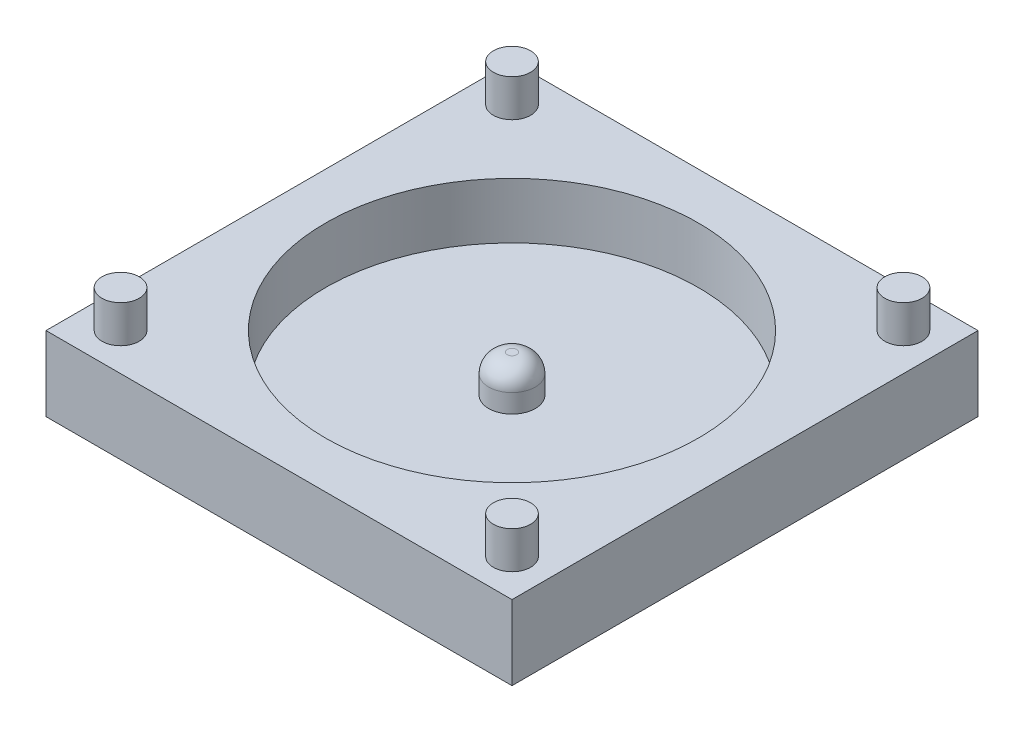
ISO-10303-21;
HEADER;
FILE_DESCRIPTION(('STEP AP214'),'2;1');
FILE_NAME('part.step','',(''),(''),'','','');
FILE_SCHEMA(('AUTOMOTIVE_DESIGN { 1 0 10303 214 1 1 1 1 }'));
ENDSEC;
DATA;
#1=APPLICATION_CONTEXT('core data for automotive mechanical design processes');
#2=APPLICATION_PROTOCOL_DEFINITION('international standard','automotive_design',2000,#1);
#3=PRODUCT_CONTEXT('',#1,'mechanical');
#4=PRODUCT('Part','Part','',(#3));
#5=PRODUCT_RELATED_PRODUCT_CATEGORY('part','',(#4));
#6=PRODUCT_DEFINITION_FORMATION('','',#4);
#7=PRODUCT_DEFINITION_CONTEXT('part definition',#1,'design');
#8=PRODUCT_DEFINITION('design','',#6,#7);
#9=PRODUCT_DEFINITION_SHAPE('','',#8);
#10=(LENGTH_UNIT() NAMED_UNIT(*) SI_UNIT(.MILLI.,.METRE.));
#11=(NAMED_UNIT(*) PLANE_ANGLE_UNIT() SI_UNIT($,.RADIAN.));
#12=(NAMED_UNIT(*) SI_UNIT($,.STERADIAN.) SOLID_ANGLE_UNIT());
#13=UNCERTAINTY_MEASURE_WITH_UNIT(LENGTH_MEASURE(1.E-05),#10,'distance_accuracy_value','');
#14=(GEOMETRIC_REPRESENTATION_CONTEXT(3) GLOBAL_UNCERTAINTY_ASSIGNED_CONTEXT((#13)) GLOBAL_UNIT_ASSIGNED_CONTEXT((#10,
#11,#12)) REPRESENTATION_CONTEXT('',''));
#15=CARTESIAN_POINT('',(0.,0.,0.));
#16=DIRECTION('',(0.,0.,1.));
#17=DIRECTION('',(1.,0.,0.));
#18=AXIS2_PLACEMENT_3D('',#15,#16,#17);
#19=CARTESIAN_POINT('',(12.5,4.,12.5));
#20=DIRECTION('',(-1.,0.,0.));
#21=DIRECTION('',(0.,0.,1.));
#22=AXIS2_PLACEMENT_3D('',#19,#20,#21);
#23=PLANE('',#22);
#24=DIRECTION('',(0.,0.,-1.));
#25=VECTOR('',#24,1.);
#26=CARTESIAN_POINT('',(12.5,0.,12.5));
#27=LINE('',#26,#25);
#28=CARTESIAN_POINT('',(12.5,0.,12.5));
#29=VERTEX_POINT('',#28);
#30=CARTESIAN_POINT('',(12.5,0.,-12.5));
#31=VERTEX_POINT('',#30);
#32=EDGE_CURVE('E101',#29,#31,#27,.T.);
#33=ORIENTED_EDGE('',*,*,#32,.T.);
#34=DIRECTION('',(0.,-1.,0.));
#35=VECTOR('',#34,1.);
#36=CARTESIAN_POINT('',(12.5,4.,-12.5));
#37=LINE('',#36,#35);
#38=CARTESIAN_POINT('',(12.5,4.,-12.5));
#39=VERTEX_POINT('',#38);
#40=EDGE_CURVE('E92',#39,#31,#37,.T.);
#41=ORIENTED_EDGE('',*,*,#40,.F.);
#42=DIRECTION('',(0.,0.,-1.));
#43=VECTOR('',#42,1.);
#44=CARTESIAN_POINT('',(12.5,4.,12.5));
#45=LINE('',#44,#43);
#46=CARTESIAN_POINT('',(12.5,4.,12.5));
#47=VERTEX_POINT('',#46);
#48=EDGE_CURVE('E86',#47,#39,#45,.T.);
#49=ORIENTED_EDGE('',*,*,#48,.F.);
#50=DIRECTION('',(0.,-1.,0.));
#51=VECTOR('',#50,1.);
#52=CARTESIAN_POINT('',(12.5,4.,12.5));
#53=LINE('',#52,#51);
#54=EDGE_CURVE('E97',#47,#29,#53,.T.);
#55=ORIENTED_EDGE('',*,*,#54,.T.);
#56=EDGE_LOOP('',(#33,#41,#49,#55));
#57=FACE_BOUND('',#56,.T.);
#58=ADVANCED_FACE('F33',(#57),#23,.F.);
#59=CARTESIAN_POINT('',(-12.5,4.,-12.5));
#60=DIRECTION('',(0.,0.,1.));
#61=DIRECTION('',(1.,0.,0.));
#62=AXIS2_PLACEMENT_3D('',#59,#60,#61);
#63=PLANE('',#62);
#64=DIRECTION('',(-1.,0.,0.));
#65=VECTOR('',#64,1.);
#66=CARTESIAN_POINT('',(-12.5,0.,-12.5));
#67=LINE('',#66,#65);
#68=CARTESIAN_POINT('',(-12.5,0.,-12.5));
#69=VERTEX_POINT('',#68);
#70=EDGE_CURVE('E91',#31,#69,#67,.T.);
#71=ORIENTED_EDGE('',*,*,#70,.T.);
#72=DIRECTION('',(0.,-1.,0.));
#73=VECTOR('',#72,1.);
#74=CARTESIAN_POINT('',(-12.5,4.,-12.5));
#75=LINE('',#74,#73);
#76=CARTESIAN_POINT('',(-12.5,4.,-12.5));
#77=VERTEX_POINT('',#76);
#78=EDGE_CURVE('E89',#77,#69,#75,.T.);
#79=ORIENTED_EDGE('',*,*,#78,.F.);
#80=DIRECTION('',(-1.,0.,0.));
#81=VECTOR('',#80,1.);
#82=CARTESIAN_POINT('',(-12.5,4.,-12.5));
#83=LINE('',#82,#81);
#84=EDGE_CURVE('E81',#39,#77,#83,.T.);
#85=ORIENTED_EDGE('',*,*,#84,.F.);
#86=ORIENTED_EDGE('',*,*,#40,.T.);
#87=EDGE_LOOP('',(#71,#79,#85,#86));
#88=FACE_BOUND('',#87,.T.);
#89=ADVANCED_FACE('F90',(#88),#63,.F.);
#90=CARTESIAN_POINT('',(-12.5,4.,12.5));
#91=DIRECTION('',(1.,0.,0.));
#92=DIRECTION('',(0.,0.,-1.));
#93=AXIS2_PLACEMENT_3D('',#90,#91,#92);
#94=PLANE('',#93);
#95=DIRECTION('',(0.,0.,1.));
#96=VECTOR('',#95,1.);
#97=CARTESIAN_POINT('',(-12.5,0.,12.5));
#98=LINE('',#97,#96);
#99=CARTESIAN_POINT('',(-12.5,0.,12.5));
#100=VERTEX_POINT('',#99);
#101=EDGE_CURVE('E67',#69,#100,#98,.T.);
#102=ORIENTED_EDGE('',*,*,#101,.T.);
#103=DIRECTION('',(0.,-1.,0.));
#104=VECTOR('',#103,1.);
#105=CARTESIAN_POINT('',(-12.5,4.,12.5));
#106=LINE('',#105,#104);
#107=CARTESIAN_POINT('',(-12.5,4.,12.5));
#108=VERTEX_POINT('',#107);
#109=EDGE_CURVE('E93',#108,#100,#106,.T.);
#110=ORIENTED_EDGE('',*,*,#109,.F.);
#111=DIRECTION('',(0.,0.,1.));
#112=VECTOR('',#111,1.);
#113=CARTESIAN_POINT('',(-12.5,4.,12.5));
#114=LINE('',#113,#112);
#115=EDGE_CURVE('E84',#77,#108,#114,.T.);
#116=ORIENTED_EDGE('',*,*,#115,.F.);
#117=ORIENTED_EDGE('',*,*,#78,.T.);
#118=EDGE_LOOP('',(#102,#110,#116,#117));
#119=FACE_BOUND('',#118,.T.);
#120=ADVANCED_FACE('F95',(#119),#94,.F.);
#121=CARTESIAN_POINT('',(-12.5,4.,12.5));
#122=DIRECTION('',(0.,0.,-1.));
#123=DIRECTION('',(-1.,0.,0.));
#124=AXIS2_PLACEMENT_3D('',#121,#122,#123);
#125=PLANE('',#124);
#126=DIRECTION('',(1.,0.,0.));
#127=VECTOR('',#126,1.);
#128=CARTESIAN_POINT('',(-12.5,0.,12.5));
#129=LINE('',#128,#127);
#130=EDGE_CURVE('E73',#100,#29,#129,.T.);
#131=ORIENTED_EDGE('',*,*,#130,.T.);
#132=ORIENTED_EDGE('',*,*,#54,.F.);
#133=DIRECTION('',(1.,0.,0.));
#134=VECTOR('',#133,1.);
#135=CARTESIAN_POINT('',(-12.5,4.,12.5));
#136=LINE('',#135,#134);
#137=EDGE_CURVE('E50',#108,#47,#136,.T.);
#138=ORIENTED_EDGE('',*,*,#137,.F.);
#139=ORIENTED_EDGE('',*,*,#109,.T.);
#140=EDGE_LOOP('',(#131,#132,#138,#139));
#141=FACE_BOUND('',#140,.T.);
#142=ADVANCED_FACE('F130',(#141),#125,.F.);
#143=CARTESIAN_POINT('',(0.,4.,0.));
#144=DIRECTION('',(0.,-1.,0.));
#145=DIRECTION('',(0.,0.,-1.));
#146=AXIS2_PLACEMENT_3D('',#143,#144,#145);
#147=PLANE('',#146);
#148=CARTESIAN_POINT('',(-10.5,4.,10.5));
#149=DIRECTION('',(0.,-1.,0.));
#150=DIRECTION('',(0.,0.,-1.));
#151=AXIS2_PLACEMENT_3D('',#148,#149,#150);
#152=CIRCLE('',#151,1.);
#153=CARTESIAN_POINT('',(-10.5,4.,9.49999999999999));
#154=VERTEX_POINT('',#153);
#155=EDGE_CURVE('E11',#154,#154,#152,.F.);
#156=ORIENTED_EDGE('',*,*,#155,.F.);
#157=EDGE_LOOP('',(#156));
#158=FACE_BOUND('',#157,.T.);
#159=CARTESIAN_POINT('',(10.5,4.,10.5));
#160=DIRECTION('',(0.,-1.,0.));
#161=DIRECTION('',(0.,0.,-1.));
#162=AXIS2_PLACEMENT_3D('',#159,#160,#161);
#163=CIRCLE('',#162,1.);
#164=CARTESIAN_POINT('',(10.5,4.,9.49999999999999));
#165=VERTEX_POINT('',#164);
#166=EDGE_CURVE('E42',#165,#165,#163,.F.);
#167=ORIENTED_EDGE('',*,*,#166,.F.);
#168=EDGE_LOOP('',(#167));
#169=FACE_BOUND('',#168,.T.);
#170=CARTESIAN_POINT('',(10.5,4.,-10.5));
#171=DIRECTION('',(0.,-1.,0.));
#172=DIRECTION('',(0.,0.,-1.));
#173=AXIS2_PLACEMENT_3D('',#170,#171,#172);
#174=CIRCLE('',#173,1.);
#175=CARTESIAN_POINT('',(10.5,4.,-11.5));
#176=VERTEX_POINT('',#175);
#177=EDGE_CURVE('E120',#176,#176,#174,.F.);
#178=ORIENTED_EDGE('',*,*,#177,.F.);
#179=EDGE_LOOP('',(#178));
#180=FACE_BOUND('',#179,.T.);
#181=CARTESIAN_POINT('',(-10.5,4.,-10.5));
#182=DIRECTION('',(0.,-1.,0.));
#183=DIRECTION('',(0.,0.,-1.));
#184=AXIS2_PLACEMENT_3D('',#181,#182,#183);
#185=CIRCLE('',#184,1.);
#186=CARTESIAN_POINT('',(-10.5,4.,-11.5));
#187=VERTEX_POINT('',#186);
#188=EDGE_CURVE('E117',#187,#187,#185,.F.);
#189=ORIENTED_EDGE('',*,*,#188,.F.);
#190=EDGE_LOOP('',(#189));
#191=FACE_BOUND('',#190,.T.);
#192=CARTESIAN_POINT('',(0.,4.,0.));
#193=DIRECTION('',(0.,1.,0.));
#194=DIRECTION('',(0.,0.,1.));
#195=AXIS2_PLACEMENT_3D('',#192,#193,#194);
#196=CIRCLE('',#195,10.);
#197=CARTESIAN_POINT('',(0.,4.,10.));
#198=VERTEX_POINT('',#197);
#199=EDGE_CURVE('E139',#198,#198,#196,.T.);
#200=ORIENTED_EDGE('',*,*,#199,.F.);
#201=EDGE_LOOP('',(#200));
#202=FACE_BOUND('',#201,.T.);
#203=ORIENTED_EDGE('',*,*,#48,.T.);
#204=ORIENTED_EDGE('',*,*,#84,.T.);
#205=ORIENTED_EDGE('',*,*,#115,.T.);
#206=ORIENTED_EDGE('',*,*,#137,.T.);
#207=EDGE_LOOP('',(#203,#204,#205,#206));
#208=FACE_BOUND('',#207,.T.);
#209=ADVANCED_FACE('F82',(#158,#169,#180,#191,#202,#208),#147,.F.);
#210=CARTESIAN_POINT('',(0.,0.,0.));
#211=DIRECTION('',(0.,-1.,0.));
#212=DIRECTION('',(0.,0.,-1.));
#213=AXIS2_PLACEMENT_3D('',#210,#211,#212);
#214=PLANE('',#213);
#215=ORIENTED_EDGE('',*,*,#32,.F.);
#216=ORIENTED_EDGE('',*,*,#130,.F.);
#217=ORIENTED_EDGE('',*,*,#101,.F.);
#218=ORIENTED_EDGE('',*,*,#70,.F.);
#219=EDGE_LOOP('',(#215,#216,#217,#218));
#220=FACE_BOUND('',#219,.T.);
#221=ADVANCED_FACE('F129',(#220),#214,.T.);
#222=CARTESIAN_POINT('',(0.,1.,0.));
#223=DIRECTION('',(0.,1.,0.));
#224=DIRECTION('',(0.,0.,1.));
#225=AXIS2_PLACEMENT_3D('',#222,#223,#224);
#226=CYLINDRICAL_SURFACE('',#225,10.);
#227=CARTESIAN_POINT('',(0.,1.,0.));
#228=DIRECTION('',(0.,1.,0.));
#229=DIRECTION('',(0.,0.,1.));
#230=AXIS2_PLACEMENT_3D('',#227,#228,#229);
#231=CIRCLE('',#230,10.);
#232=CARTESIAN_POINT('',(0.,1.,10.));
#233=VERTEX_POINT('',#232);
#234=EDGE_CURVE('E104',#233,#233,#231,.T.);
#235=ORIENTED_EDGE('',*,*,#234,.F.);
#236=EDGE_LOOP('',(#235));
#237=FACE_BOUND('',#236,.T.);
#238=ORIENTED_EDGE('',*,*,#199,.T.);
#239=EDGE_LOOP('',(#238));
#240=FACE_BOUND('',#239,.T.);
#241=ADVANCED_FACE('F188',(#237,#240),#226,.F.);
#242=CARTESIAN_POINT('',(0.,1.,0.));
#243=DIRECTION('',(0.,1.,0.));
#244=DIRECTION('',(0.,0.,1.));
#245=AXIS2_PLACEMENT_3D('',#242,#243,#244);
#246=PLANE('',#245);
#247=CARTESIAN_POINT('',(0.,1.,0.));
#248=DIRECTION('',(0.,1.,0.));
#249=DIRECTION('',(0.,0.,1.));
#250=AXIS2_PLACEMENT_3D('',#247,#248,#249);
#251=CIRCLE('',#250,1.25);
#252=CARTESIAN_POINT('',(0.,1.,1.25));
#253=VERTEX_POINT('',#252);
#254=EDGE_CURVE('E141',#253,#253,#251,.T.);
#255=ORIENTED_EDGE('',*,*,#254,.F.);
#256=EDGE_LOOP('',(#255));
#257=FACE_BOUND('',#256,.T.);
#258=ORIENTED_EDGE('',*,*,#234,.T.);
#259=EDGE_LOOP('',(#258));
#260=FACE_BOUND('',#259,.T.);
#261=ADVANCED_FACE('F193',(#257,#260),#246,.T.);
#262=CARTESIAN_POINT('',(0.,3.,0.));
#263=DIRECTION('',(0.,-1.,0.));
#264=DIRECTION('',(0.,0.,-1.));
#265=AXIS2_PLACEMENT_3D('',#262,#263,#264);
#266=CYLINDRICAL_SURFACE('',#265,1.25);
#267=CARTESIAN_POINT('',(0.,2.,0.));
#268=DIRECTION('',(0.,1.,0.));
#269=DIRECTION('',(0.,0.,1.));
#270=AXIS2_PLACEMENT_3D('',#267,#268,#269);
#271=CIRCLE('',#270,1.25);
#272=CARTESIAN_POINT('',(0.,2.,1.25));
#273=VERTEX_POINT('',#272);
#274=EDGE_CURVE('E114',#273,#273,#271,.F.);
#275=ORIENTED_EDGE('',*,*,#274,.T.);
#276=EDGE_LOOP('',(#275));
#277=FACE_BOUND('',#276,.T.);
#278=ORIENTED_EDGE('',*,*,#254,.T.);
#279=EDGE_LOOP('',(#278));
#280=FACE_BOUND('',#279,.T.);
#281=ADVANCED_FACE('F197',(#277,#280),#266,.T.);
#282=CARTESIAN_POINT('',(0.,3.,0.));
#283=DIRECTION('',(0.,1.,0.));
#284=DIRECTION('',(0.,0.,1.));
#285=AXIS2_PLACEMENT_3D('',#282,#283,#284);
#286=PLANE('',#285);
#287=CARTESIAN_POINT('',(0.,3.,0.));
#288=DIRECTION('',(0.,1.,0.));
#289=DIRECTION('',(0.,0.,1.));
#290=AXIS2_PLACEMENT_3D('',#287,#288,#289);
#291=CIRCLE('',#290,0.25);
#292=CARTESIAN_POINT('',(0.,3.,0.25));
#293=VERTEX_POINT('',#292);
#294=EDGE_CURVE('E111',#293,#293,#291,.T.);
#295=ORIENTED_EDGE('',*,*,#294,.T.);
#296=EDGE_LOOP('',(#295));
#297=FACE_BOUND('',#296,.T.);
#298=ADVANCED_FACE('F201',(#297),#286,.T.);
#299=CARTESIAN_POINT('',(0.,2.,0.));
#300=DIRECTION('',(0.,1.,0.));
#301=DIRECTION('',(0.,0.,1.));
#302=AXIS2_PLACEMENT_3D('',#299,#300,#301);
#303=DEGENERATE_TOROIDAL_SURFACE('',#302,0.25,1.,.T.);
#304=ORIENTED_EDGE('',*,*,#274,.F.);
#305=EDGE_LOOP('',(#304));
#306=FACE_BOUND('',#305,.T.);
#307=ORIENTED_EDGE('',*,*,#294,.F.);
#308=EDGE_LOOP('',(#307));
#309=FACE_BOUND('',#308,.T.);
#310=ADVANCED_FACE('F35',(#306,#309),#303,.T.);
#311=CARTESIAN_POINT('',(-10.5,6.,-10.5));
#312=DIRECTION('',(0.,-1.,0.));
#313=DIRECTION('',(0.,0.,-1.));
#314=AXIS2_PLACEMENT_3D('',#311,#312,#313);
#315=CYLINDRICAL_SURFACE('',#314,1.);
#316=CARTESIAN_POINT('',(-10.5,6.,-10.5));
#317=DIRECTION('',(0.,1.,0.));
#318=DIRECTION('',(0.,0.,1.));
#319=AXIS2_PLACEMENT_3D('',#316,#317,#318);
#320=CIRCLE('',#319,1.);
#321=CARTESIAN_POINT('',(-10.5,6.,-9.5));
#322=VERTEX_POINT('',#321);
#323=EDGE_CURVE('E146',#322,#322,#320,.T.);
#324=ORIENTED_EDGE('',*,*,#323,.F.);
#325=EDGE_LOOP('',(#324));
#326=FACE_BOUND('',#325,.T.);
#327=ORIENTED_EDGE('',*,*,#188,.T.);
#328=EDGE_LOOP('',(#327));
#329=FACE_BOUND('',#328,.T.);
#330=ADVANCED_FACE('F206',(#326,#329),#315,.T.);
#331=CARTESIAN_POINT('',(-10.5,6.,-10.5));
#332=DIRECTION('',(0.,1.,0.));
#333=DIRECTION('',(0.,0.,1.));
#334=AXIS2_PLACEMENT_3D('',#331,#332,#333);
#335=PLANE('',#334);
#336=ORIENTED_EDGE('',*,*,#323,.T.);
#337=EDGE_LOOP('',(#336));
#338=FACE_BOUND('',#337,.T.);
#339=ADVANCED_FACE('F209',(#338),#335,.T.);
#340=CARTESIAN_POINT('',(10.5,6.,-10.5));
#341=DIRECTION('',(0.,-1.,0.));
#342=DIRECTION('',(0.,0.,-1.));
#343=AXIS2_PLACEMENT_3D('',#340,#341,#342);
#344=CYLINDRICAL_SURFACE('',#343,1.);
#345=CARTESIAN_POINT('',(10.5,6.,-10.5));
#346=DIRECTION('',(0.,1.,0.));
#347=DIRECTION('',(0.,0.,1.));
#348=AXIS2_PLACEMENT_3D('',#345,#346,#347);
#349=CIRCLE('',#348,1.);
#350=CARTESIAN_POINT('',(10.5,6.,-9.5));
#351=VERTEX_POINT('',#350);
#352=EDGE_CURVE('E151',#351,#351,#349,.T.);
#353=ORIENTED_EDGE('',*,*,#352,.F.);
#354=EDGE_LOOP('',(#353));
#355=FACE_BOUND('',#354,.T.);
#356=ORIENTED_EDGE('',*,*,#177,.T.);
#357=EDGE_LOOP('',(#356));
#358=FACE_BOUND('',#357,.T.);
#359=ADVANCED_FACE('F213',(#355,#358),#344,.T.);
#360=CARTESIAN_POINT('',(10.5,6.,-10.5));
#361=DIRECTION('',(0.,1.,0.));
#362=DIRECTION('',(0.,0.,1.));
#363=AXIS2_PLACEMENT_3D('',#360,#361,#362);
#364=PLANE('',#363);
#365=ORIENTED_EDGE('',*,*,#352,.T.);
#366=EDGE_LOOP('',(#365));
#367=FACE_BOUND('',#366,.T.);
#368=ADVANCED_FACE('F217',(#367),#364,.T.);
#369=CARTESIAN_POINT('',(10.5,6.,10.5));
#370=DIRECTION('',(0.,-1.,0.));
#371=DIRECTION('',(0.,0.,-1.));
#372=AXIS2_PLACEMENT_3D('',#369,#370,#371);
#373=CYLINDRICAL_SURFACE('',#372,1.);
#374=CARTESIAN_POINT('',(10.5,6.,10.5));
#375=DIRECTION('',(0.,1.,0.));
#376=DIRECTION('',(0.,0.,1.));
#377=AXIS2_PLACEMENT_3D('',#374,#375,#376);
#378=CIRCLE('',#377,1.);
#379=CARTESIAN_POINT('',(10.5,6.,11.5));
#380=VERTEX_POINT('',#379);
#381=EDGE_CURVE('E154',#380,#380,#378,.T.);
#382=ORIENTED_EDGE('',*,*,#381,.F.);
#383=EDGE_LOOP('',(#382));
#384=FACE_BOUND('',#383,.T.);
#385=ORIENTED_EDGE('',*,*,#166,.T.);
#386=EDGE_LOOP('',(#385));
#387=FACE_BOUND('',#386,.T.);
#388=ADVANCED_FACE('F125',(#384,#387),#373,.T.);
#389=CARTESIAN_POINT('',(10.5,6.,10.5));
#390=DIRECTION('',(0.,1.,0.));
#391=DIRECTION('',(0.,0.,1.));
#392=AXIS2_PLACEMENT_3D('',#389,#390,#391);
#393=PLANE('',#392);
#394=ORIENTED_EDGE('',*,*,#381,.T.);
#395=EDGE_LOOP('',(#394));
#396=FACE_BOUND('',#395,.T.);
#397=ADVANCED_FACE('F166',(#396),#393,.T.);
#398=CARTESIAN_POINT('',(-10.5,6.,10.5));
#399=DIRECTION('',(0.,-1.,0.));
#400=DIRECTION('',(0.,0.,-1.));
#401=AXIS2_PLACEMENT_3D('',#398,#399,#400);
#402=CYLINDRICAL_SURFACE('',#401,1.);
#403=CARTESIAN_POINT('',(-10.5,6.,10.5));
#404=DIRECTION('',(0.,1.,0.));
#405=DIRECTION('',(0.,0.,1.));
#406=AXIS2_PLACEMENT_3D('',#403,#404,#405);
#407=CIRCLE('',#406,1.);
#408=CARTESIAN_POINT('',(-10.5,6.,11.5));
#409=VERTEX_POINT('',#408);
#410=EDGE_CURVE('E157',#409,#409,#407,.T.);
#411=ORIENTED_EDGE('',*,*,#410,.F.);
#412=EDGE_LOOP('',(#411));
#413=FACE_BOUND('',#412,.T.);
#414=ORIENTED_EDGE('',*,*,#155,.T.);
#415=EDGE_LOOP('',(#414));
#416=FACE_BOUND('',#415,.T.);
#417=ADVANCED_FACE('F163',(#413,#416),#402,.T.);
#418=CARTESIAN_POINT('',(-10.5,6.,10.5));
#419=DIRECTION('',(0.,1.,0.));
#420=DIRECTION('',(0.,0.,1.));
#421=AXIS2_PLACEMENT_3D('',#418,#419,#420);
#422=PLANE('',#421);
#423=ORIENTED_EDGE('',*,*,#410,.T.);
#424=EDGE_LOOP('',(#423));
#425=FACE_BOUND('',#424,.T.);
#426=ADVANCED_FACE('F161',(#425),#422,.T.);
#427=CLOSED_SHELL('',(#58,#89,#120,#142,#209,#221,#241,#261,#281,#298,#310,#330,#339,#359,#368,
#388,#397,#417,#426));
#428=MANIFOLD_SOLID_BREP('B2',#427);
#429=ADVANCED_BREP_SHAPE_REPRESENTATION('',(#18,#428),#14);
#430=SHAPE_DEFINITION_REPRESENTATION(#9,#429);
ENDSEC;
END-ISO-10303-21;
